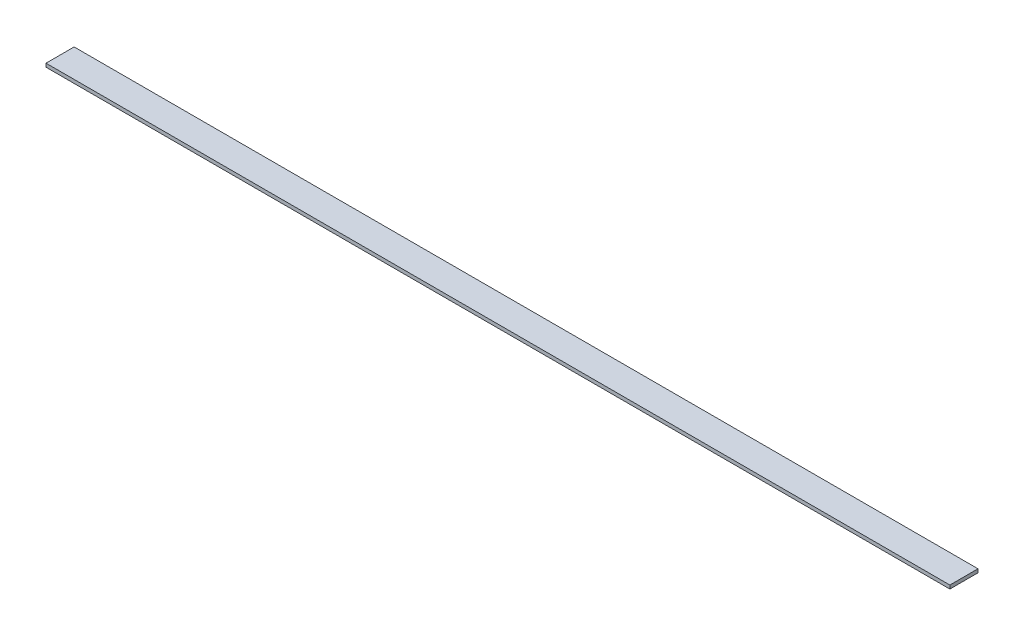
ISO-10303-21;
HEADER;
FILE_DESCRIPTION(('STEP AP214'),'2;1');
FILE_NAME('part.step','',(''),(''),'','','');
FILE_SCHEMA(('AUTOMOTIVE_DESIGN { 1 0 10303 214 1 1 1 1 }'));
ENDSEC;
DATA;
#1=APPLICATION_CONTEXT('core data for automotive mechanical design processes');
#2=APPLICATION_PROTOCOL_DEFINITION('international standard','automotive_design',2000,#1);
#3=PRODUCT_CONTEXT('',#1,'mechanical');
#4=PRODUCT('Part','Part','',(#3));
#5=PRODUCT_RELATED_PRODUCT_CATEGORY('part','',(#4));
#6=PRODUCT_DEFINITION_FORMATION('','',#4);
#7=PRODUCT_DEFINITION_CONTEXT('part definition',#1,'design');
#8=PRODUCT_DEFINITION('design','',#6,#7);
#9=PRODUCT_DEFINITION_SHAPE('','',#8);
#10=(LENGTH_UNIT() NAMED_UNIT(*) SI_UNIT(.MILLI.,.METRE.));
#11=(NAMED_UNIT(*) PLANE_ANGLE_UNIT() SI_UNIT($,.RADIAN.));
#12=(NAMED_UNIT(*) SI_UNIT($,.STERADIAN.) SOLID_ANGLE_UNIT());
#13=UNCERTAINTY_MEASURE_WITH_UNIT(LENGTH_MEASURE(1.E-05),#10,'distance_accuracy_value','');
#14=(GEOMETRIC_REPRESENTATION_CONTEXT(3) GLOBAL_UNCERTAINTY_ASSIGNED_CONTEXT((#13)) GLOBAL_UNIT_ASSIGNED_CONTEXT((#10,
#11,#12)) REPRESENTATION_CONTEXT('',''));
#15=CARTESIAN_POINT('',(0.,0.,0.));
#16=DIRECTION('',(0.,0.,1.));
#17=DIRECTION('',(1.,0.,0.));
#18=AXIS2_PLACEMENT_3D('',#15,#16,#17);
#19=CARTESIAN_POINT('',(0.,6.35,0.));
#20=DIRECTION('',(1.,0.,0.));
#21=DIRECTION('',(0.,0.,-1.));
#22=AXIS2_PLACEMENT_3D('',#19,#20,#21);
#23=PLANE('',#22);
#24=DIRECTION('',(0.,0.,1.));
#25=VECTOR('',#24,1.);
#26=CARTESIAN_POINT('',(0.,0.,0.));
#27=LINE('',#26,#25);
#28=CARTESIAN_POINT('',(0.,0.,-50.8));
#29=VERTEX_POINT('',#28);
#30=CARTESIAN_POINT('',(0.,0.,0.));
#31=VERTEX_POINT('',#30);
#32=EDGE_CURVE('E98',#29,#31,#27,.T.);
#33=ORIENTED_EDGE('',*,*,#32,.T.);
#34=DIRECTION('',(0.,-1.,0.));
#35=VECTOR('',#34,1.);
#36=CARTESIAN_POINT('',(0.,6.35,0.));
#37=LINE('',#36,#35);
#38=CARTESIAN_POINT('',(0.,6.35,0.));
#39=VERTEX_POINT('',#38);
#40=EDGE_CURVE('E11',#39,#31,#37,.T.);
#41=ORIENTED_EDGE('',*,*,#40,.F.);
#42=DIRECTION('',(0.,0.,1.));
#43=VECTOR('',#42,1.);
#44=CARTESIAN_POINT('',(0.,6.35,0.));
#45=LINE('',#44,#43);
#46=CARTESIAN_POINT('',(0.,6.35,-50.8));
#47=VERTEX_POINT('',#46);
#48=EDGE_CURVE('E86',#47,#39,#45,.T.);
#49=ORIENTED_EDGE('',*,*,#48,.F.);
#50=DIRECTION('',(0.,-1.,0.));
#51=VECTOR('',#50,1.);
#52=CARTESIAN_POINT('',(0.,6.35,-50.8));
#53=LINE('',#52,#51);
#54=EDGE_CURVE('E94',#47,#29,#53,.T.);
#55=ORIENTED_EDGE('',*,*,#54,.T.);
#56=EDGE_LOOP('',(#33,#41,#49,#55));
#57=FACE_BOUND('',#56,.T.);
#58=ADVANCED_FACE('F35',(#57),#23,.F.);
#59=CARTESIAN_POINT('',(0.,6.35,0.));
#60=DIRECTION('',(0.,0.,-1.));
#61=DIRECTION('',(-1.,0.,0.));
#62=AXIS2_PLACEMENT_3D('',#59,#60,#61);
#63=PLANE('',#62);
#64=DIRECTION('',(1.,0.,0.));
#65=VECTOR('',#64,1.);
#66=CARTESIAN_POINT('',(0.,0.,0.));
#67=LINE('',#66,#65);
#68=CARTESIAN_POINT('',(1631.95,0.,0.));
#69=VERTEX_POINT('',#68);
#70=EDGE_CURVE('E90',#31,#69,#67,.T.);
#71=ORIENTED_EDGE('',*,*,#70,.T.);
#72=DIRECTION('',(0.,-1.,0.));
#73=VECTOR('',#72,1.);
#74=CARTESIAN_POINT('',(1631.95,6.35,0.));
#75=LINE('',#74,#73);
#76=CARTESIAN_POINT('',(1631.95,6.35,0.));
#77=VERTEX_POINT('',#76);
#78=EDGE_CURVE('E43',#77,#69,#75,.T.);
#79=ORIENTED_EDGE('',*,*,#78,.F.);
#80=DIRECTION('',(1.,0.,0.));
#81=VECTOR('',#80,1.);
#82=CARTESIAN_POINT('',(0.,6.35,0.));
#83=LINE('',#82,#81);
#84=EDGE_CURVE('E81',#39,#77,#83,.T.);
#85=ORIENTED_EDGE('',*,*,#84,.F.);
#86=ORIENTED_EDGE('',*,*,#40,.T.);
#87=EDGE_LOOP('',(#71,#79,#85,#86));
#88=FACE_BOUND('',#87,.T.);
#89=ADVANCED_FACE('F89',(#88),#63,.F.);
#90=CARTESIAN_POINT('',(1631.95,6.35,0.));
#91=DIRECTION('',(-1.,0.,0.));
#92=DIRECTION('',(0.,0.,1.));
#93=AXIS2_PLACEMENT_3D('',#90,#91,#92);
#94=PLANE('',#93);
#95=DIRECTION('',(0.,0.,-1.));
#96=VECTOR('',#95,1.);
#97=CARTESIAN_POINT('',(1631.95,0.,0.));
#98=LINE('',#97,#96);
#99=CARTESIAN_POINT('',(1631.95,0.,-50.8));
#100=VERTEX_POINT('',#99);
#101=EDGE_CURVE('E68',#69,#100,#98,.T.);
#102=ORIENTED_EDGE('',*,*,#101,.T.);
#103=DIRECTION('',(0.,-1.,0.));
#104=VECTOR('',#103,1.);
#105=CARTESIAN_POINT('',(1631.95,6.35,-50.8));
#106=LINE('',#105,#104);
#107=CARTESIAN_POINT('',(1631.95,6.35,-50.8));
#108=VERTEX_POINT('',#107);
#109=EDGE_CURVE('E91',#108,#100,#106,.T.);
#110=ORIENTED_EDGE('',*,*,#109,.F.);
#111=DIRECTION('',(0.,0.,-1.));
#112=VECTOR('',#111,1.);
#113=CARTESIAN_POINT('',(1631.95,6.35,0.));
#114=LINE('',#113,#112);
#115=EDGE_CURVE('E84',#77,#108,#114,.T.);
#116=ORIENTED_EDGE('',*,*,#115,.F.);
#117=ORIENTED_EDGE('',*,*,#78,.T.);
#118=EDGE_LOOP('',(#102,#110,#116,#117));
#119=FACE_BOUND('',#118,.T.);
#120=ADVANCED_FACE('F92',(#119),#94,.F.);
#121=CARTESIAN_POINT('',(0.,6.35,-50.8));
#122=DIRECTION('',(0.,0.,1.));
#123=DIRECTION('',(1.,0.,0.));
#124=AXIS2_PLACEMENT_3D('',#121,#122,#123);
#125=PLANE('',#124);
#126=DIRECTION('',(-1.,0.,0.));
#127=VECTOR('',#126,1.);
#128=CARTESIAN_POINT('',(0.,0.,-50.8));
#129=LINE('',#128,#127);
#130=EDGE_CURVE('E74',#100,#29,#129,.T.);
#131=ORIENTED_EDGE('',*,*,#130,.T.);
#132=ORIENTED_EDGE('',*,*,#54,.F.);
#133=DIRECTION('',(-1.,0.,0.));
#134=VECTOR('',#133,1.);
#135=CARTESIAN_POINT('',(0.,6.35,-50.8));
#136=LINE('',#135,#134);
#137=EDGE_CURVE('E51',#108,#47,#136,.T.);
#138=ORIENTED_EDGE('',*,*,#137,.F.);
#139=ORIENTED_EDGE('',*,*,#109,.T.);
#140=EDGE_LOOP('',(#131,#132,#138,#139));
#141=FACE_BOUND('',#140,.T.);
#142=ADVANCED_FACE('F105',(#141),#125,.F.);
#143=CARTESIAN_POINT('',(0.,6.35,-50.8));
#144=DIRECTION('',(0.,-1.,0.));
#145=DIRECTION('',(0.,0.,-1.));
#146=AXIS2_PLACEMENT_3D('',#143,#144,#145);
#147=PLANE('',#146);
#148=ORIENTED_EDGE('',*,*,#48,.T.);
#149=ORIENTED_EDGE('',*,*,#84,.T.);
#150=ORIENTED_EDGE('',*,*,#115,.T.);
#151=ORIENTED_EDGE('',*,*,#137,.T.);
#152=EDGE_LOOP('',(#148,#149,#150,#151));
#153=FACE_BOUND('',#152,.T.);
#154=ADVANCED_FACE('F82',(#153),#147,.F.);
#155=CARTESIAN_POINT('',(0.,0.,-50.8));
#156=DIRECTION('',(0.,-1.,0.));
#157=DIRECTION('',(0.,0.,-1.));
#158=AXIS2_PLACEMENT_3D('',#155,#156,#157);
#159=PLANE('',#158);
#160=ORIENTED_EDGE('',*,*,#32,.F.);
#161=ORIENTED_EDGE('',*,*,#130,.F.);
#162=ORIENTED_EDGE('',*,*,#101,.F.);
#163=ORIENTED_EDGE('',*,*,#70,.F.);
#164=EDGE_LOOP('',(#160,#161,#162,#163));
#165=FACE_BOUND('',#164,.T.);
#166=ADVANCED_FACE('F108',(#165),#159,.T.);
#167=CLOSED_SHELL('',(#58,#89,#120,#142,#154,#166));
#168=MANIFOLD_SOLID_BREP('B2',#167);
#169=ADVANCED_BREP_SHAPE_REPRESENTATION('',(#18,#168),#14);
#170=SHAPE_DEFINITION_REPRESENTATION(#9,#169);
ENDSEC;
END-ISO-10303-21;
